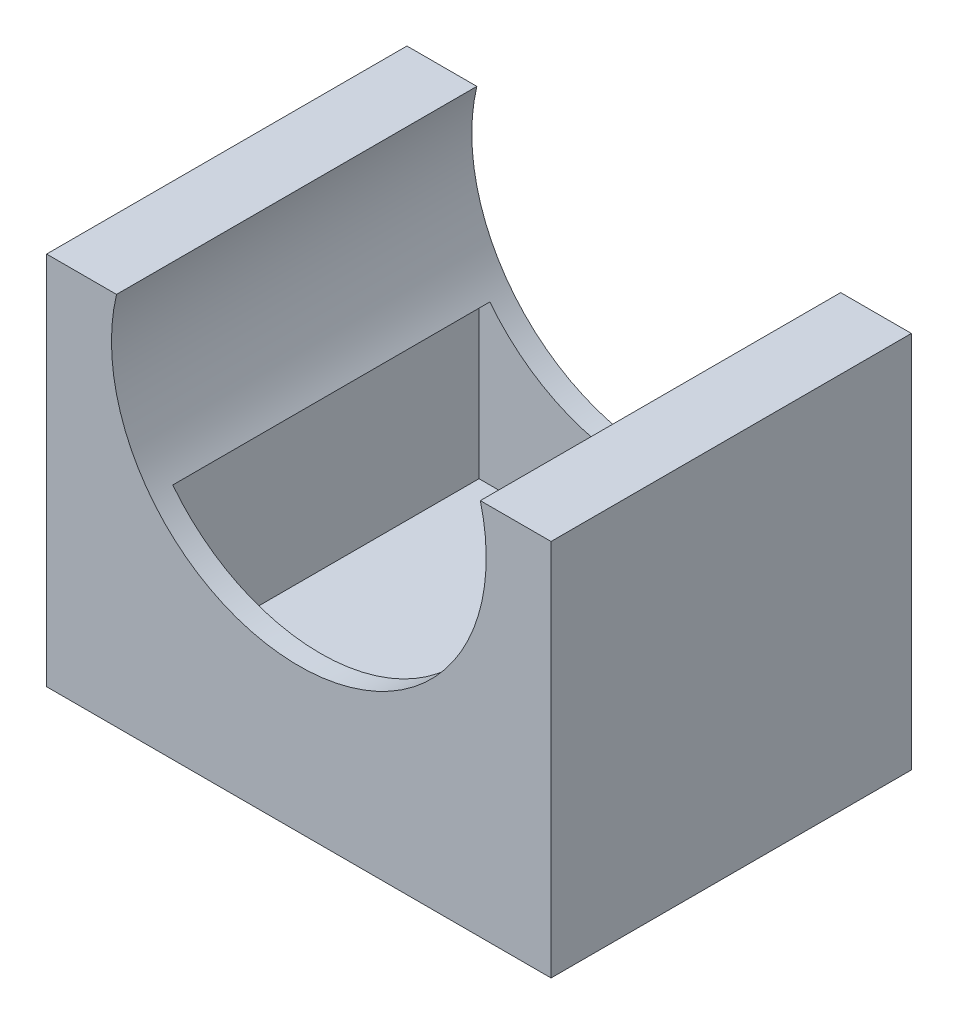
ISO-10303-21;
HEADER;
FILE_DESCRIPTION(('STEP AP214'),'2;1');
FILE_NAME('part.step','',(''),(''),'','','');
FILE_SCHEMA(('AUTOMOTIVE_DESIGN { 1 0 10303 214 1 1 1 1 }'));
ENDSEC;
DATA;
#1=APPLICATION_CONTEXT('core data for automotive mechanical design processes');
#2=APPLICATION_PROTOCOL_DEFINITION('international standard','automotive_design',2000,#1);
#3=PRODUCT_CONTEXT('',#1,'mechanical');
#4=PRODUCT('Part','Part','',(#3));
#5=PRODUCT_RELATED_PRODUCT_CATEGORY('part','',(#4));
#6=PRODUCT_DEFINITION_FORMATION('','',#4);
#7=PRODUCT_DEFINITION_CONTEXT('part definition',#1,'design');
#8=PRODUCT_DEFINITION('design','',#6,#7);
#9=PRODUCT_DEFINITION_SHAPE('','',#8);
#10=(LENGTH_UNIT() NAMED_UNIT(*) SI_UNIT(.MILLI.,.METRE.));
#11=(NAMED_UNIT(*) PLANE_ANGLE_UNIT() SI_UNIT($,.RADIAN.));
#12=(NAMED_UNIT(*) SI_UNIT($,.STERADIAN.) SOLID_ANGLE_UNIT());
#13=UNCERTAINTY_MEASURE_WITH_UNIT(LENGTH_MEASURE(1.E-05),#10,'distance_accuracy_value','');
#14=(GEOMETRIC_REPRESENTATION_CONTEXT(3) GLOBAL_UNCERTAINTY_ASSIGNED_CONTEXT((#13)) GLOBAL_UNIT_ASSIGNED_CONTEXT((#10,
#11,#12)) REPRESENTATION_CONTEXT('',''));
#15=CARTESIAN_POINT('',(0.,0.,0.));
#16=DIRECTION('',(0.,0.,1.));
#17=DIRECTION('',(1.,0.,0.));
#18=AXIS2_PLACEMENT_3D('',#15,#16,#17);
#19=CARTESIAN_POINT('',(35.,40.,50.));
#20=DIRECTION('',(0.,0.,-1.));
#21=DIRECTION('',(-1.,0.,0.));
#22=AXIS2_PLACEMENT_3D('',#19,#20,#21);
#23=CYLINDRICAL_SURFACE('',#22,26.);
#24=CARTESIAN_POINT('',(35.,40.,0.));
#25=DIRECTION('',(0.,0.,1.));
#26=DIRECTION('',(1.,0.,0.));
#27=AXIS2_PLACEMENT_3D('',#24,#25,#26);
#28=CIRCLE('',#27,26.);
#29=CARTESIAN_POINT('',(60.1848955733689,46.4591822205683,0.));
#30=VERTEX_POINT('',#29);
#31=CARTESIAN_POINT('',(9.70177871865297,46.,0.));
#32=VERTEX_POINT('',#31);
#33=EDGE_CURVE('E231',#30,#32,#28,.F.);
#34=ORIENTED_EDGE('',*,*,#33,.T.);
#35=DIRECTION('',(0.,0.,-1.));
#36=VECTOR('',#35,1.);
#37=CARTESIAN_POINT('',(9.70177871865297,46.,50.));
#38=LINE('',#37,#36);
#39=CARTESIAN_POINT('',(9.70177871865297,46.,50.));
#40=VERTEX_POINT('',#39);
#41=EDGE_CURVE('E246',#40,#32,#38,.T.);
#42=ORIENTED_EDGE('',*,*,#41,.F.);
#43=CARTESIAN_POINT('',(35.,40.,50.));
#44=DIRECTION('',(0.,0.,1.));
#45=DIRECTION('',(1.,0.,0.));
#46=AXIS2_PLACEMENT_3D('',#43,#44,#45);
#47=CIRCLE('',#46,26.);
#48=CARTESIAN_POINT('',(60.1848955733689,46.4591822205683,50.));
#49=VERTEX_POINT('',#48);
#50=EDGE_CURVE('E221',#49,#40,#47,.F.);
#51=ORIENTED_EDGE('',*,*,#50,.F.);
#52=DIRECTION('',(0.,0.,-1.));
#53=VECTOR('',#52,1.);
#54=CARTESIAN_POINT('',(60.1848955733689,46.4591822205683,50.));
#55=LINE('',#54,#53);
#56=EDGE_CURVE('E89',#49,#30,#55,.T.);
#57=ORIENTED_EDGE('',*,*,#56,.T.);
#58=EDGE_LOOP('',(#34,#42,#51,#57));
#59=FACE_BOUND('',#58,.T.);
#60=CARTESIAN_POINT('',(35.,40.,47.));
#61=DIRECTION('',(0.,0.,-1.));
#62=DIRECTION('',(-1.,0.,0.));
#63=AXIS2_PLACEMENT_3D('',#60,#61,#62);
#64=CIRCLE('',#63,26.);
#65=CARTESIAN_POINT('',(14.5060984680808,24.,47.));
#66=VERTEX_POINT('',#65);
#67=CARTESIAN_POINT('',(55.4939015319192,24.,47.));
#68=VERTEX_POINT('',#67);
#69=EDGE_CURVE('E255',#66,#68,#64,.F.);
#70=ORIENTED_EDGE('',*,*,#69,.F.);
#71=DIRECTION('',(0.,0.,-1.));
#72=VECTOR('',#71,1.);
#73=CARTESIAN_POINT('',(14.5060984680808,24.,50.));
#74=LINE('',#73,#72);
#75=CARTESIAN_POINT('',(14.5060984680808,24.,3.00000000000001));
#76=VERTEX_POINT('',#75);
#77=EDGE_CURVE('E50',#66,#76,#74,.T.);
#78=ORIENTED_EDGE('',*,*,#77,.T.);
#79=CARTESIAN_POINT('',(35.,40.,3.));
#80=DIRECTION('',(0.,0.,1.));
#81=DIRECTION('',(1.,0.,0.));
#82=AXIS2_PLACEMENT_3D('',#79,#80,#81);
#83=CIRCLE('',#82,26.);
#84=CARTESIAN_POINT('',(55.4939015319192,24.,3.));
#85=VERTEX_POINT('',#84);
#86=EDGE_CURVE('E252',#85,#76,#83,.F.);
#87=ORIENTED_EDGE('',*,*,#86,.F.);
#88=DIRECTION('',(0.,0.,-1.));
#89=VECTOR('',#88,1.);
#90=CARTESIAN_POINT('',(55.4939015319192,24.,50.));
#91=LINE('',#90,#89);
#92=EDGE_CURVE('E11',#85,#68,#91,.F.);
#93=ORIENTED_EDGE('',*,*,#92,.T.);
#94=EDGE_LOOP('',(#70,#78,#87,#93));
#95=FACE_BOUND('',#94,.T.);
#96=ADVANCED_FACE('F41',(#59,#95),#23,.F.);
#97=CARTESIAN_POINT('',(0.,46.4591822205683,50.));
#98=DIRECTION('',(0.,1.,0.));
#99=DIRECTION('',(0.,0.,1.));
#100=AXIS2_PLACEMENT_3D('',#97,#98,#99);
#101=PLANE('',#100);
#102=DIRECTION('',(1.,0.,0.));
#103=VECTOR('',#102,1.);
#104=CARTESIAN_POINT('',(0.,46.4591822205683,0.));
#105=LINE('',#104,#103);
#106=CARTESIAN_POINT('',(70.,46.4591822205683,0.));
#107=VERTEX_POINT('',#106);
#108=EDGE_CURVE('E217',#30,#107,#105,.T.);
#109=ORIENTED_EDGE('',*,*,#108,.F.);
#110=ORIENTED_EDGE('',*,*,#56,.F.);
#111=DIRECTION('',(1.,0.,0.));
#112=VECTOR('',#111,1.);
#113=CARTESIAN_POINT('',(0.,46.4591822205683,50.));
#114=LINE('',#113,#112);
#115=CARTESIAN_POINT('',(70.,46.4591822205683,50.));
#116=VERTEX_POINT('',#115);
#117=EDGE_CURVE('E218',#49,#116,#114,.T.);
#118=ORIENTED_EDGE('',*,*,#117,.T.);
#119=DIRECTION('',(0.,0.,-1.));
#120=VECTOR('',#119,1.);
#121=CARTESIAN_POINT('',(70.,46.4591822205683,50.));
#122=LINE('',#121,#120);
#123=EDGE_CURVE('E66',#116,#107,#122,.T.);
#124=ORIENTED_EDGE('',*,*,#123,.T.);
#125=EDGE_LOOP('',(#109,#110,#118,#124));
#126=FACE_BOUND('',#125,.T.);
#127=ADVANCED_FACE('F43',(#126),#101,.T.);
#128=CARTESIAN_POINT('',(0.,46.,50.));
#129=DIRECTION('',(0.,-1.,0.));
#130=DIRECTION('',(0.,0.,-1.));
#131=AXIS2_PLACEMENT_3D('',#128,#129,#130);
#132=PLANE('',#131);
#133=DIRECTION('',(-1.,0.,0.));
#134=VECTOR('',#133,1.);
#135=CARTESIAN_POINT('',(0.,46.,0.));
#136=LINE('',#135,#134);
#137=CARTESIAN_POINT('',(0.,46.,0.));
#138=VERTEX_POINT('',#137);
#139=EDGE_CURVE('E234',#32,#138,#136,.T.);
#140=ORIENTED_EDGE('',*,*,#139,.T.);
#141=DIRECTION('',(0.,0.,-1.));
#142=VECTOR('',#141,1.);
#143=CARTESIAN_POINT('',(0.,46.,50.));
#144=LINE('',#143,#142);
#145=CARTESIAN_POINT('',(0.,46.,50.));
#146=VERTEX_POINT('',#145);
#147=EDGE_CURVE('E243',#146,#138,#144,.T.);
#148=ORIENTED_EDGE('',*,*,#147,.F.);
#149=DIRECTION('',(-1.,0.,0.));
#150=VECTOR('',#149,1.);
#151=CARTESIAN_POINT('',(0.,46.,50.));
#152=LINE('',#151,#150);
#153=EDGE_CURVE('E145',#40,#146,#152,.T.);
#154=ORIENTED_EDGE('',*,*,#153,.F.);
#155=ORIENTED_EDGE('',*,*,#41,.T.);
#156=EDGE_LOOP('',(#140,#148,#154,#155));
#157=FACE_BOUND('',#156,.T.);
#158=ADVANCED_FACE('F301',(#157),#132,.F.);
#159=CARTESIAN_POINT('',(0.,0.,50.));
#160=DIRECTION('',(1.,0.,0.));
#161=DIRECTION('',(0.,0.,-1.));
#162=AXIS2_PLACEMENT_3D('',#159,#160,#161);
#163=PLANE('',#162);
#164=DIRECTION('',(0.,-1.,0.));
#165=VECTOR('',#164,1.);
#166=CARTESIAN_POINT('',(0.,0.,0.));
#167=LINE('',#166,#165);
#168=CARTESIAN_POINT('',(0.,-6.,0.));
#169=VERTEX_POINT('',#168);
#170=EDGE_CURVE('E165',#138,#169,#167,.T.);
#171=ORIENTED_EDGE('',*,*,#170,.T.);
#172=DIRECTION('',(0.,0.,-1.));
#173=VECTOR('',#172,1.);
#174=CARTESIAN_POINT('',(0.,-6.,50.));
#175=LINE('',#174,#173);
#176=CARTESIAN_POINT('',(0.,-6.,50.));
#177=VERTEX_POINT('',#176);
#178=EDGE_CURVE('E157',#177,#169,#175,.T.);
#179=ORIENTED_EDGE('',*,*,#178,.F.);
#180=DIRECTION('',(0.,-1.,0.));
#181=VECTOR('',#180,1.);
#182=CARTESIAN_POINT('',(0.,0.,50.));
#183=LINE('',#182,#181);
#184=EDGE_CURVE('E137',#146,#177,#183,.T.);
#185=ORIENTED_EDGE('',*,*,#184,.F.);
#186=ORIENTED_EDGE('',*,*,#147,.T.);
#187=EDGE_LOOP('',(#171,#179,#185,#186));
#188=FACE_BOUND('',#187,.T.);
#189=ADVANCED_FACE('F163',(#188),#163,.F.);
#190=CARTESIAN_POINT('',(70.,0.,50.));
#191=DIRECTION('',(1.,0.,0.));
#192=DIRECTION('',(0.,0.,-1.));
#193=AXIS2_PLACEMENT_3D('',#190,#191,#192);
#194=PLANE('',#193);
#195=DIRECTION('',(0.,-1.,0.));
#196=VECTOR('',#195,1.);
#197=CARTESIAN_POINT('',(70.,0.,0.));
#198=LINE('',#197,#196);
#199=CARTESIAN_POINT('',(70.,-6.,0.));
#200=VERTEX_POINT('',#199);
#201=EDGE_CURVE('E222',#107,#200,#198,.T.);
#202=ORIENTED_EDGE('',*,*,#201,.F.);
#203=ORIENTED_EDGE('',*,*,#123,.F.);
#204=DIRECTION('',(0.,-1.,0.));
#205=VECTOR('',#204,1.);
#206=CARTESIAN_POINT('',(70.,0.,50.));
#207=LINE('',#206,#205);
#208=CARTESIAN_POINT('',(70.,-6.,50.));
#209=VERTEX_POINT('',#208);
#210=EDGE_CURVE('E151',#116,#209,#207,.T.);
#211=ORIENTED_EDGE('',*,*,#210,.T.);
#212=DIRECTION('',(0.,0.,-1.));
#213=VECTOR('',#212,1.);
#214=CARTESIAN_POINT('',(70.,-6.,50.));
#215=LINE('',#214,#213);
#216=EDGE_CURVE('E159',#209,#200,#215,.T.);
#217=ORIENTED_EDGE('',*,*,#216,.T.);
#218=EDGE_LOOP('',(#202,#203,#211,#217));
#219=FACE_BOUND('',#218,.T.);
#220=ADVANCED_FACE('F308',(#219),#194,.T.);
#221=CARTESIAN_POINT('',(0.,0.,50.));
#222=DIRECTION('',(0.,0.,1.));
#223=DIRECTION('',(1.,0.,0.));
#224=AXIS2_PLACEMENT_3D('',#221,#222,#223);
#225=PLANE('',#224);
#226=ORIENTED_EDGE('',*,*,#117,.F.);
#227=ORIENTED_EDGE('',*,*,#50,.T.);
#228=ORIENTED_EDGE('',*,*,#153,.T.);
#229=ORIENTED_EDGE('',*,*,#184,.T.);
#230=DIRECTION('',(1.,0.,0.));
#231=VECTOR('',#230,1.);
#232=CARTESIAN_POINT('',(0.,-6.,50.));
#233=LINE('',#232,#231);
#234=EDGE_CURVE('E142',#177,#209,#233,.T.);
#235=ORIENTED_EDGE('',*,*,#234,.T.);
#236=ORIENTED_EDGE('',*,*,#210,.F.);
#237=EDGE_LOOP('',(#226,#227,#228,#229,#235,#236));
#238=FACE_BOUND('',#237,.T.);
#239=ADVANCED_FACE('F140',(#238),#225,.T.);
#240=CARTESIAN_POINT('',(0.,0.,0.));
#241=DIRECTION('',(0.,0.,1.));
#242=DIRECTION('',(1.,0.,0.));
#243=AXIS2_PLACEMENT_3D('',#240,#241,#242);
#244=PLANE('',#243);
#245=ORIENTED_EDGE('',*,*,#108,.T.);
#246=ORIENTED_EDGE('',*,*,#201,.T.);
#247=DIRECTION('',(1.,0.,0.));
#248=VECTOR('',#247,1.);
#249=CARTESIAN_POINT('',(0.,-6.,0.));
#250=LINE('',#249,#248);
#251=EDGE_CURVE('E161',#169,#200,#250,.T.);
#252=ORIENTED_EDGE('',*,*,#251,.F.);
#253=ORIENTED_EDGE('',*,*,#170,.F.);
#254=ORIENTED_EDGE('',*,*,#139,.F.);
#255=ORIENTED_EDGE('',*,*,#33,.F.);
#256=EDGE_LOOP('',(#245,#246,#252,#253,#254,#255));
#257=FACE_BOUND('',#256,.T.);
#258=ADVANCED_FACE('F311',(#257),#244,.F.);
#259=CARTESIAN_POINT('',(57.,24.,47.));
#260=DIRECTION('',(0.,0.,-1.));
#261=DIRECTION('',(-1.,0.,0.));
#262=AXIS2_PLACEMENT_3D('',#259,#260,#261);
#263=PLANE('',#262);
#264=DIRECTION('',(1.,0.,0.));
#265=VECTOR('',#264,1.);
#266=CARTESIAN_POINT('',(57.,24.,47.));
#267=LINE('',#266,#265);
#268=CARTESIAN_POINT('',(13.,24.,47.));
#269=VERTEX_POINT('',#268);
#270=EDGE_CURVE('E194',#269,#66,#267,.T.);
#271=ORIENTED_EDGE('',*,*,#270,.T.);
#272=ORIENTED_EDGE('',*,*,#69,.T.);
#273=CARTESIAN_POINT('',(57.,24.,47.));
#274=VERTEX_POINT('',#273);
#275=EDGE_CURVE('E193',#68,#274,#267,.T.);
#276=ORIENTED_EDGE('',*,*,#275,.T.);
#277=DIRECTION('',(0.,-1.,0.));
#278=VECTOR('',#277,1.);
#279=CARTESIAN_POINT('',(57.,24.,47.));
#280=LINE('',#279,#278);
#281=CARTESIAN_POINT('',(57.,2.,47.));
#282=VERTEX_POINT('',#281);
#283=EDGE_CURVE('E211',#274,#282,#280,.T.);
#284=ORIENTED_EDGE('',*,*,#283,.T.);
#285=DIRECTION('',(1.,0.,0.));
#286=VECTOR('',#285,1.);
#287=CARTESIAN_POINT('',(13.,2.,47.));
#288=LINE('',#287,#286);
#289=CARTESIAN_POINT('',(13.,2.,47.));
#290=VERTEX_POINT('',#289);
#291=EDGE_CURVE('E173',#290,#282,#288,.T.);
#292=ORIENTED_EDGE('',*,*,#291,.F.);
#293=DIRECTION('',(0.,-1.,0.));
#294=VECTOR('',#293,1.);
#295=CARTESIAN_POINT('',(13.,24.,47.));
#296=LINE('',#295,#294);
#297=EDGE_CURVE('E214',#269,#290,#296,.T.);
#298=ORIENTED_EDGE('',*,*,#297,.F.);
#299=EDGE_LOOP('',(#271,#272,#276,#284,#292,#298));
#300=FACE_BOUND('',#299,.T.);
#301=ADVANCED_FACE('F264',(#300),#263,.T.);
#302=CARTESIAN_POINT('',(57.,24.,3.));
#303=DIRECTION('',(0.,0.,1.));
#304=DIRECTION('',(1.,0.,0.));
#305=AXIS2_PLACEMENT_3D('',#302,#303,#304);
#306=PLANE('',#305);
#307=DIRECTION('',(-1.,0.,0.));
#308=VECTOR('',#307,1.);
#309=CARTESIAN_POINT('',(57.,24.,3.));
#310=LINE('',#309,#308);
#311=CARTESIAN_POINT('',(57.,24.,3.));
#312=VERTEX_POINT('',#311);
#313=EDGE_CURVE('E201',#312,#85,#310,.T.);
#314=ORIENTED_EDGE('',*,*,#313,.T.);
#315=ORIENTED_EDGE('',*,*,#86,.T.);
#316=CARTESIAN_POINT('',(13.,24.,3.00000000000001));
#317=VERTEX_POINT('',#316);
#318=EDGE_CURVE('E57',#76,#317,#310,.T.);
#319=ORIENTED_EDGE('',*,*,#318,.T.);
#320=DIRECTION('',(0.,-1.,0.));
#321=VECTOR('',#320,1.);
#322=CARTESIAN_POINT('',(13.,24.,3.00000000000001));
#323=LINE('',#322,#321);
#324=CARTESIAN_POINT('',(13.,2.,3.00000000000001));
#325=VERTEX_POINT('',#324);
#326=EDGE_CURVE('E205',#317,#325,#323,.T.);
#327=ORIENTED_EDGE('',*,*,#326,.T.);
#328=DIRECTION('',(-1.,0.,0.));
#329=VECTOR('',#328,1.);
#330=CARTESIAN_POINT('',(13.,2.,3.00000000000001));
#331=LINE('',#330,#329);
#332=CARTESIAN_POINT('',(57.,2.,3.00000000000001));
#333=VERTEX_POINT('',#332);
#334=EDGE_CURVE('E185',#333,#325,#331,.T.);
#335=ORIENTED_EDGE('',*,*,#334,.F.);
#336=DIRECTION('',(0.,-1.,0.));
#337=VECTOR('',#336,1.);
#338=CARTESIAN_POINT('',(57.,24.,3.));
#339=LINE('',#338,#337);
#340=EDGE_CURVE('E208',#312,#333,#339,.T.);
#341=ORIENTED_EDGE('',*,*,#340,.F.);
#342=EDGE_LOOP('',(#314,#315,#319,#327,#335,#341));
#343=FACE_BOUND('',#342,.T.);
#344=ADVANCED_FACE('F273',(#343),#306,.T.);
#345=CARTESIAN_POINT('',(0.,24.,0.));
#346=DIRECTION('',(0.,1.,0.));
#347=DIRECTION('',(0.,0.,1.));
#348=AXIS2_PLACEMENT_3D('',#345,#346,#347);
#349=PLANE('',#348);
#350=ORIENTED_EDGE('',*,*,#313,.F.);
#351=DIRECTION('',(0.,0.,-1.));
#352=VECTOR('',#351,1.);
#353=CARTESIAN_POINT('',(57.,24.,47.));
#354=LINE('',#353,#352);
#355=EDGE_CURVE('E198',#274,#312,#354,.T.);
#356=ORIENTED_EDGE('',*,*,#355,.F.);
#357=ORIENTED_EDGE('',*,*,#275,.F.);
#358=ORIENTED_EDGE('',*,*,#92,.F.);
#359=EDGE_LOOP('',(#350,#356,#357,#358));
#360=FACE_BOUND('',#359,.T.);
#361=ADVANCED_FACE('F284',(#360),#349,.F.);
#362=ORIENTED_EDGE('',*,*,#270,.F.);
#363=DIRECTION('',(0.,0.,1.));
#364=VECTOR('',#363,1.);
#365=CARTESIAN_POINT('',(13.,24.,47.));
#366=LINE('',#365,#364);
#367=EDGE_CURVE('E189',#317,#269,#366,.T.);
#368=ORIENTED_EDGE('',*,*,#367,.F.);
#369=ORIENTED_EDGE('',*,*,#318,.F.);
#370=ORIENTED_EDGE('',*,*,#77,.F.);
#371=EDGE_LOOP('',(#362,#368,#369,#370));
#372=FACE_BOUND('',#371,.T.);
#373=ADVANCED_FACE('F261',(#372),#349,.F.);
#374=CARTESIAN_POINT('',(13.,24.,47.));
#375=DIRECTION('',(1.,0.,0.));
#376=DIRECTION('',(0.,0.,-1.));
#377=AXIS2_PLACEMENT_3D('',#374,#375,#376);
#378=PLANE('',#377);
#379=ORIENTED_EDGE('',*,*,#297,.T.);
#380=DIRECTION('',(0.,0.,1.));
#381=VECTOR('',#380,1.);
#382=CARTESIAN_POINT('',(13.,2.,3.00000000000001));
#383=LINE('',#382,#381);
#384=EDGE_CURVE('E168',#325,#290,#383,.T.);
#385=ORIENTED_EDGE('',*,*,#384,.F.);
#386=ORIENTED_EDGE('',*,*,#326,.F.);
#387=ORIENTED_EDGE('',*,*,#367,.T.);
#388=EDGE_LOOP('',(#379,#385,#386,#387));
#389=FACE_BOUND('',#388,.T.);
#390=ADVANCED_FACE('F269',(#389),#378,.T.);
#391=CARTESIAN_POINT('',(57.,24.,47.));
#392=DIRECTION('',(-1.,0.,0.));
#393=DIRECTION('',(0.,0.,1.));
#394=AXIS2_PLACEMENT_3D('',#391,#392,#393);
#395=PLANE('',#394);
#396=ORIENTED_EDGE('',*,*,#340,.T.);
#397=DIRECTION('',(0.,0.,-1.));
#398=VECTOR('',#397,1.);
#399=CARTESIAN_POINT('',(57.,2.,3.00000000000001));
#400=LINE('',#399,#398);
#401=EDGE_CURVE('E181',#282,#333,#400,.T.);
#402=ORIENTED_EDGE('',*,*,#401,.F.);
#403=ORIENTED_EDGE('',*,*,#283,.F.);
#404=ORIENTED_EDGE('',*,*,#355,.T.);
#405=EDGE_LOOP('',(#396,#402,#403,#404));
#406=FACE_BOUND('',#405,.T.);
#407=ADVANCED_FACE('F282',(#406),#395,.T.);
#408=CARTESIAN_POINT('',(0.,2.,0.));
#409=DIRECTION('',(0.,1.,0.));
#410=DIRECTION('',(0.,0.,1.));
#411=AXIS2_PLACEMENT_3D('',#408,#409,#410);
#412=PLANE('',#411);
#413=ORIENTED_EDGE('',*,*,#384,.T.);
#414=ORIENTED_EDGE('',*,*,#291,.T.);
#415=ORIENTED_EDGE('',*,*,#401,.T.);
#416=ORIENTED_EDGE('',*,*,#334,.T.);
#417=EDGE_LOOP('',(#413,#414,#415,#416));
#418=FACE_BOUND('',#417,.T.);
#419=ADVANCED_FACE('F286',(#418),#412,.T.);
#420=CARTESIAN_POINT('',(0.,-6.,50.));
#421=DIRECTION('',(0.,1.,0.));
#422=DIRECTION('',(0.,0.,1.));
#423=AXIS2_PLACEMENT_3D('',#420,#421,#422);
#424=PLANE('',#423);
#425=ORIENTED_EDGE('',*,*,#251,.T.);
#426=ORIENTED_EDGE('',*,*,#216,.F.);
#427=ORIENTED_EDGE('',*,*,#234,.F.);
#428=ORIENTED_EDGE('',*,*,#178,.T.);
#429=EDGE_LOOP('',(#425,#426,#427,#428));
#430=FACE_BOUND('',#429,.T.);
#431=ADVANCED_FACE('F156',(#430),#424,.F.);
#432=CLOSED_SHELL('',(#96,#127,#158,#189,#220,#239,#258,#301,#344,#361,#373,#390,#407,#419,#431));
#433=MANIFOLD_SOLID_BREP('B2',#432);
#434=ADVANCED_BREP_SHAPE_REPRESENTATION('',(#18,#433),#14);
#435=SHAPE_DEFINITION_REPRESENTATION(#9,#434);
ENDSEC;
END-ISO-10303-21;
